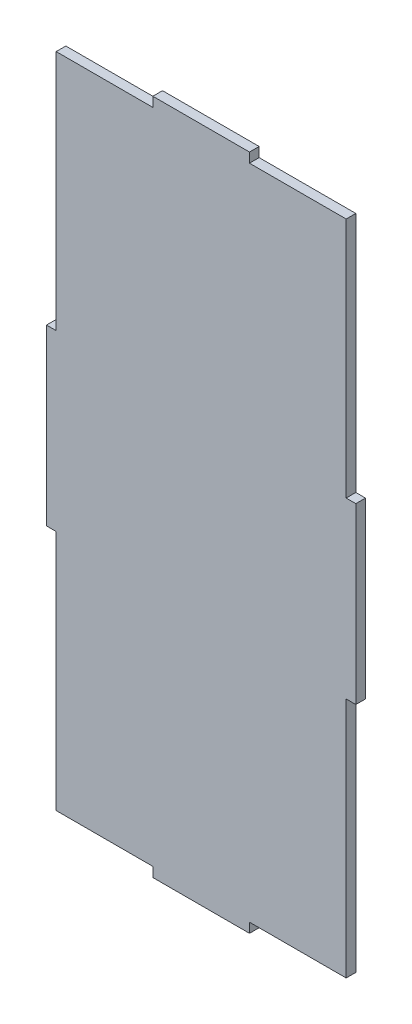
ISO-10303-21;
HEADER;
FILE_DESCRIPTION(('STEP AP214'),'2;1');
FILE_NAME('part.step','',(''),(''),'','','');
FILE_SCHEMA(('AUTOMOTIVE_DESIGN { 1 0 10303 214 1 1 1 1 }'));
ENDSEC;
DATA;
#1=APPLICATION_CONTEXT('core data for automotive mechanical design processes');
#2=APPLICATION_PROTOCOL_DEFINITION('international standard','automotive_design',2000,#1);
#3=PRODUCT_CONTEXT('',#1,'mechanical');
#4=PRODUCT('Part','Part','',(#3));
#5=PRODUCT_RELATED_PRODUCT_CATEGORY('part','',(#4));
#6=PRODUCT_DEFINITION_FORMATION('','',#4);
#7=PRODUCT_DEFINITION_CONTEXT('part definition',#1,'design');
#8=PRODUCT_DEFINITION('design','',#6,#7);
#9=PRODUCT_DEFINITION_SHAPE('','',#8);
#10=(LENGTH_UNIT() NAMED_UNIT(*) SI_UNIT(.MILLI.,.METRE.));
#11=(NAMED_UNIT(*) PLANE_ANGLE_UNIT() SI_UNIT($,.RADIAN.));
#12=(NAMED_UNIT(*) SI_UNIT($,.STERADIAN.) SOLID_ANGLE_UNIT());
#13=UNCERTAINTY_MEASURE_WITH_UNIT(LENGTH_MEASURE(1.E-05),#10,'distance_accuracy_value','');
#14=(GEOMETRIC_REPRESENTATION_CONTEXT(3) GLOBAL_UNCERTAINTY_ASSIGNED_CONTEXT((#13)) GLOBAL_UNIT_ASSIGNED_CONTEXT((#10,
#11,#12)) REPRESENTATION_CONTEXT('',''));
#15=CARTESIAN_POINT('',(0.,0.,0.));
#16=DIRECTION('',(0.,0.,1.));
#17=DIRECTION('',(1.,0.,0.));
#18=AXIS2_PLACEMENT_3D('',#15,#16,#17);
#19=CARTESIAN_POINT('',(0.,0.,6.35));
#20=DIRECTION('',(0.,0.,1.));
#21=DIRECTION('',(1.,0.,0.));
#22=AXIS2_PLACEMENT_3D('',#19,#20,#21);
#23=PLANE('',#22);
#24=DIRECTION('',(0.,1.,0.));
#25=VECTOR('',#24,1.);
#26=CARTESIAN_POINT('',(-437.71235835235,2.12580200527452E-13,6.35));
#27=LINE('',#26,#25);
#28=CARTESIAN_POINT('',(-437.71235835235,116.758620123206,6.34999999999997));
#29=VERTEX_POINT('',#28);
#30=CARTESIAN_POINT('',(-437.71235835235,231.058620123206,6.35));
#31=VERTEX_POINT('',#30);
#32=EDGE_CURVE('E48',#29,#31,#27,.T.);
#33=ORIENTED_EDGE('',*,*,#32,.F.);
#34=DIRECTION('',(-1.,0.,0.));
#35=VECTOR('',#34,1.);
#36=CARTESIAN_POINT('',(1.27586720850635E-13,116.758620123206,6.35));
#37=LINE('',#36,#35);
#38=CARTESIAN_POINT('',(-431.36235835235,116.758620123206,6.34999999999997));
#39=VERTEX_POINT('',#38);
#40=EDGE_CURVE('E179',#39,#29,#37,.T.);
#41=ORIENTED_EDGE('',*,*,#40,.F.);
#42=DIRECTION('',(0.,1.,0.));
#43=VECTOR('',#42,1.);
#44=CARTESIAN_POINT('',(-431.36235835235,0.,6.35));
#45=LINE('',#44,#43);
#46=CARTESIAN_POINT('',(-431.36235835235,-41.9913798767936,6.34999999999997));
#47=VERTEX_POINT('',#46);
#48=EDGE_CURVE('E192',#47,#39,#45,.T.);
#49=ORIENTED_EDGE('',*,*,#48,.F.);
#50=DIRECTION('',(-1.,0.,0.));
#51=VECTOR('',#50,1.);
#52=CARTESIAN_POINT('',(0.,-41.9913798767937,6.35));
#53=LINE('',#52,#51);
#54=CARTESIAN_POINT('',(-367.86235835235,-41.9913798767936,6.34999999999997));
#55=VERTEX_POINT('',#54);
#56=EDGE_CURVE('E280',#55,#47,#53,.T.);
#57=ORIENTED_EDGE('',*,*,#56,.F.);
#58=DIRECTION('',(0.,1.,0.));
#59=VECTOR('',#58,1.);
#60=CARTESIAN_POINT('',(-367.86235835235,0.,6.35));
#61=LINE('',#60,#59);
#62=CARTESIAN_POINT('',(-367.86235835235,-48.3413798767936,6.35));
#63=VERTEX_POINT('',#62);
#64=EDGE_CURVE('E278',#63,#55,#61,.T.);
#65=ORIENTED_EDGE('',*,*,#64,.F.);
#66=DIRECTION('',(-1.,0.,0.));
#67=VECTOR('',#66,1.);
#68=CARTESIAN_POINT('',(0.,-48.3413798767935,6.35));
#69=LINE('',#68,#67);
#70=CARTESIAN_POINT('',(-304.36235835235,-48.3413798767936,6.34999999999997));
#71=VERTEX_POINT('',#70);
#72=EDGE_CURVE('E264',#71,#63,#69,.T.);
#73=ORIENTED_EDGE('',*,*,#72,.F.);
#74=DIRECTION('',(0.,1.,0.));
#75=VECTOR('',#74,1.);
#76=CARTESIAN_POINT('',(-304.36235835235,0.,6.35));
#77=LINE('',#76,#75);
#78=CARTESIAN_POINT('',(-304.36235835235,-41.9913798767936,6.35));
#79=VERTEX_POINT('',#78);
#80=EDGE_CURVE('E270',#71,#79,#77,.T.);
#81=ORIENTED_EDGE('',*,*,#80,.T.);
#82=DIRECTION('',(1.,0.,0.));
#83=VECTOR('',#82,1.);
#84=CARTESIAN_POINT('',(0.,-41.9913798767936,6.35));
#85=LINE('',#84,#83);
#86=CARTESIAN_POINT('',(-240.86235835235,-41.9913798767936,6.35));
#87=VERTEX_POINT('',#86);
#88=EDGE_CURVE('E272',#79,#87,#85,.T.);
#89=ORIENTED_EDGE('',*,*,#88,.T.);
#90=DIRECTION('',(0.,-1.,0.));
#91=VECTOR('',#90,1.);
#92=CARTESIAN_POINT('',(-240.86235835235,0.,6.35));
#93=LINE('',#92,#91);
#94=CARTESIAN_POINT('',(-240.86235835235,116.758620123206,6.35));
#95=VERTEX_POINT('',#94);
#96=EDGE_CURVE('E220',#95,#87,#93,.T.);
#97=ORIENTED_EDGE('',*,*,#96,.F.);
#98=DIRECTION('',(-1.,0.,0.));
#99=VECTOR('',#98,1.);
#100=CARTESIAN_POINT('',(0.,116.758620123206,6.35));
#101=LINE('',#100,#99);
#102=CARTESIAN_POINT('',(-234.51235835235,116.758620123206,6.35));
#103=VERTEX_POINT('',#102);
#104=EDGE_CURVE('E225',#103,#95,#101,.T.);
#105=ORIENTED_EDGE('',*,*,#104,.F.);
#106=DIRECTION('',(0.,-1.,0.));
#107=VECTOR('',#106,1.);
#108=CARTESIAN_POINT('',(-234.51235835235,231.058620123206,6.35));
#109=LINE('',#108,#107);
#110=CARTESIAN_POINT('',(-234.51235835235,231.058620123206,6.35));
#111=VERTEX_POINT('',#110);
#112=EDGE_CURVE('E190',#111,#103,#109,.T.);
#113=ORIENTED_EDGE('',*,*,#112,.F.);
#114=DIRECTION('',(-1.,0.,0.));
#115=VECTOR('',#114,1.);
#116=CARTESIAN_POINT('',(0.,231.058620123206,6.35));
#117=LINE('',#116,#115);
#118=CARTESIAN_POINT('',(-240.86235835235,231.058620123206,6.35));
#119=VERTEX_POINT('',#118);
#120=EDGE_CURVE('E212',#111,#119,#117,.T.);
#121=ORIENTED_EDGE('',*,*,#120,.T.);
#122=DIRECTION('',(0.,1.,0.));
#123=VECTOR('',#122,1.);
#124=CARTESIAN_POINT('',(-240.86235835235,0.,6.35));
#125=LINE('',#124,#123);
#126=CARTESIAN_POINT('',(-240.86235835235,389.808620123206,6.34999999999997));
#127=VERTEX_POINT('',#126);
#128=EDGE_CURVE('E207',#119,#127,#125,.T.);
#129=ORIENTED_EDGE('',*,*,#128,.T.);
#130=DIRECTION('',(1.,0.,0.));
#131=VECTOR('',#130,1.);
#132=CARTESIAN_POINT('',(0.,389.808620123206,6.35));
#133=LINE('',#132,#131);
#134=CARTESIAN_POINT('',(-304.36235835235,389.808620123206,6.34999999999997));
#135=VERTEX_POINT('',#134);
#136=EDGE_CURVE('E241',#135,#127,#133,.T.);
#137=ORIENTED_EDGE('',*,*,#136,.F.);
#138=DIRECTION('',(0.,-1.,0.));
#139=VECTOR('',#138,1.);
#140=CARTESIAN_POINT('',(-304.36235835235,0.,6.35));
#141=LINE('',#140,#139);
#142=CARTESIAN_POINT('',(-304.36235835235,396.158620123206,6.35));
#143=VERTEX_POINT('',#142);
#144=EDGE_CURVE('E245',#143,#135,#141,.T.);
#145=ORIENTED_EDGE('',*,*,#144,.F.);
#146=DIRECTION('',(1.,0.,0.));
#147=VECTOR('',#146,1.);
#148=CARTESIAN_POINT('',(0.,396.158620123206,6.35));
#149=LINE('',#148,#147);
#150=CARTESIAN_POINT('',(-367.86235835235,396.158620123206,6.34999999999997));
#151=VERTEX_POINT('',#150);
#152=EDGE_CURVE('E233',#151,#143,#149,.T.);
#153=ORIENTED_EDGE('',*,*,#152,.F.);
#154=DIRECTION('',(0.,-1.,0.));
#155=VECTOR('',#154,1.);
#156=CARTESIAN_POINT('',(-367.86235835235,0.,6.35));
#157=LINE('',#156,#155);
#158=CARTESIAN_POINT('',(-367.86235835235,389.808620123206,6.35));
#159=VERTEX_POINT('',#158);
#160=EDGE_CURVE('E257',#151,#159,#157,.T.);
#161=ORIENTED_EDGE('',*,*,#160,.T.);
#162=DIRECTION('',(-1.,0.,0.));
#163=VECTOR('',#162,1.);
#164=CARTESIAN_POINT('',(0.,389.808620123206,6.35));
#165=LINE('',#164,#163);
#166=CARTESIAN_POINT('',(-431.36235835235,389.808620123206,6.35));
#167=VERTEX_POINT('',#166);
#168=EDGE_CURVE('E252',#159,#167,#165,.T.);
#169=ORIENTED_EDGE('',*,*,#168,.T.);
#170=DIRECTION('',(0.,1.,0.));
#171=VECTOR('',#170,1.);
#172=CARTESIAN_POINT('',(-431.36235835235,0.,6.35));
#173=LINE('',#172,#171);
#174=CARTESIAN_POINT('',(-431.36235835235,231.058620123206,6.35));
#175=VERTEX_POINT('',#174);
#176=EDGE_CURVE('E314',#175,#167,#173,.T.);
#177=ORIENTED_EDGE('',*,*,#176,.F.);
#178=DIRECTION('',(1.,0.,0.));
#179=VECTOR('',#178,1.);
#180=CARTESIAN_POINT('',(0.,231.058620123206,6.35));
#181=LINE('',#180,#179);
#182=EDGE_CURVE('E54',#31,#175,#181,.T.);
#183=ORIENTED_EDGE('',*,*,#182,.F.);
#184=EDGE_LOOP('',(#33,#41,#49,#57,#65,#73,#81,#89,#97,#105,#113,#121,#129,#137,#145,#153,#161,
#169,#177,#183));
#185=FACE_BOUND('',#184,.T.);
#186=ADVANCED_FACE('F33',(#185),#23,.T.);
#187=CARTESIAN_POINT('',(0.,0.,0.));
#188=DIRECTION('',(0.,0.,1.));
#189=DIRECTION('',(1.,0.,0.));
#190=AXIS2_PLACEMENT_3D('',#187,#188,#189);
#191=PLANE('',#190);
#192=DIRECTION('',(-1.,0.,0.));
#193=VECTOR('',#192,1.);
#194=CARTESIAN_POINT('',(1.27586720850635E-13,116.758620123206,0.));
#195=LINE('',#194,#193);
#196=CARTESIAN_POINT('',(-431.36235835235,116.758620123206,0.));
#197=VERTEX_POINT('',#196);
#198=CARTESIAN_POINT('',(-437.71235835235,116.758620123206,0.));
#199=VERTEX_POINT('',#198);
#200=EDGE_CURVE('E187',#197,#199,#195,.T.);
#201=ORIENTED_EDGE('',*,*,#200,.T.);
#202=DIRECTION('',(0.,1.,0.));
#203=VECTOR('',#202,1.);
#204=CARTESIAN_POINT('',(-437.71235835235,2.12580200527452E-13,0.));
#205=LINE('',#204,#203);
#206=CARTESIAN_POINT('',(-437.71235835235,231.058620123206,0.));
#207=VERTEX_POINT('',#206);
#208=EDGE_CURVE('E171',#199,#207,#205,.T.);
#209=ORIENTED_EDGE('',*,*,#208,.T.);
#210=DIRECTION('',(1.,0.,0.));
#211=VECTOR('',#210,1.);
#212=CARTESIAN_POINT('',(0.,231.058620123206,0.));
#213=LINE('',#212,#211);
#214=CARTESIAN_POINT('',(-431.36235835235,231.058620123206,0.));
#215=VERTEX_POINT('',#214);
#216=EDGE_CURVE('E328',#207,#215,#213,.T.);
#217=ORIENTED_EDGE('',*,*,#216,.T.);
#218=DIRECTION('',(0.,1.,0.));
#219=VECTOR('',#218,1.);
#220=CARTESIAN_POINT('',(-431.36235835235,0.,0.));
#221=LINE('',#220,#219);
#222=CARTESIAN_POINT('',(-431.36235835235,389.808620123206,0.));
#223=VERTEX_POINT('',#222);
#224=EDGE_CURVE('E313',#215,#223,#221,.T.);
#225=ORIENTED_EDGE('',*,*,#224,.T.);
#226=DIRECTION('',(-1.,0.,0.));
#227=VECTOR('',#226,1.);
#228=CARTESIAN_POINT('',(0.,389.808620123206,0.));
#229=LINE('',#228,#227);
#230=CARTESIAN_POINT('',(-367.86235835235,389.808620123206,0.));
#231=VERTEX_POINT('',#230);
#232=EDGE_CURVE('E250',#231,#223,#229,.T.);
#233=ORIENTED_EDGE('',*,*,#232,.F.);
#234=DIRECTION('',(0.,-1.,0.));
#235=VECTOR('',#234,1.);
#236=CARTESIAN_POINT('',(-367.86235835235,0.,0.));
#237=LINE('',#236,#235);
#238=CARTESIAN_POINT('',(-367.86235835235,396.158620123206,0.));
#239=VERTEX_POINT('',#238);
#240=EDGE_CURVE('E255',#239,#231,#237,.T.);
#241=ORIENTED_EDGE('',*,*,#240,.F.);
#242=DIRECTION('',(1.,0.,0.));
#243=VECTOR('',#242,1.);
#244=CARTESIAN_POINT('',(0.,396.158620123206,0.));
#245=LINE('',#244,#243);
#246=CARTESIAN_POINT('',(-304.36235835235,396.158620123206,0.));
#247=VERTEX_POINT('',#246);
#248=EDGE_CURVE('E230',#239,#247,#245,.T.);
#249=ORIENTED_EDGE('',*,*,#248,.T.);
#250=DIRECTION('',(0.,-1.,0.));
#251=VECTOR('',#250,1.);
#252=CARTESIAN_POINT('',(-304.36235835235,0.,0.));
#253=LINE('',#252,#251);
#254=CARTESIAN_POINT('',(-304.36235835235,389.808620123206,0.));
#255=VERTEX_POINT('',#254);
#256=EDGE_CURVE('E243',#247,#255,#253,.T.);
#257=ORIENTED_EDGE('',*,*,#256,.T.);
#258=DIRECTION('',(1.,0.,0.));
#259=VECTOR('',#258,1.);
#260=CARTESIAN_POINT('',(0.,389.808620123206,0.));
#261=LINE('',#260,#259);
#262=CARTESIAN_POINT('',(-240.86235835235,389.808620123206,0.));
#263=VERTEX_POINT('',#262);
#264=EDGE_CURVE('E238',#255,#263,#261,.T.);
#265=ORIENTED_EDGE('',*,*,#264,.T.);
#266=DIRECTION('',(0.,1.,0.));
#267=VECTOR('',#266,1.);
#268=CARTESIAN_POINT('',(-240.86235835235,0.,0.));
#269=LINE('',#268,#267);
#270=CARTESIAN_POINT('',(-240.86235835235,231.058620123206,0.));
#271=VERTEX_POINT('',#270);
#272=EDGE_CURVE('E204',#271,#263,#269,.T.);
#273=ORIENTED_EDGE('',*,*,#272,.F.);
#274=DIRECTION('',(-1.,0.,0.));
#275=VECTOR('',#274,1.);
#276=CARTESIAN_POINT('',(0.,231.058620123206,0.));
#277=LINE('',#276,#275);
#278=CARTESIAN_POINT('',(-234.51235835235,231.058620123206,0.));
#279=VERTEX_POINT('',#278);
#280=EDGE_CURVE('E210',#279,#271,#277,.T.);
#281=ORIENTED_EDGE('',*,*,#280,.F.);
#282=DIRECTION('',(0.,1.,0.));
#283=VECTOR('',#282,1.);
#284=CARTESIAN_POINT('',(-234.51235835235,0.,0.));
#285=LINE('',#284,#283);
#286=CARTESIAN_POINT('',(-234.51235835235,116.758620123206,0.));
#287=VERTEX_POINT('',#286);
#288=EDGE_CURVE('E198',#287,#279,#285,.T.);
#289=ORIENTED_EDGE('',*,*,#288,.F.);
#290=DIRECTION('',(-1.,0.,0.));
#291=VECTOR('',#290,1.);
#292=CARTESIAN_POINT('',(0.,116.758620123206,0.));
#293=LINE('',#292,#291);
#294=CARTESIAN_POINT('',(-240.86235835235,116.758620123206,0.));
#295=VERTEX_POINT('',#294);
#296=EDGE_CURVE('E223',#287,#295,#293,.T.);
#297=ORIENTED_EDGE('',*,*,#296,.T.);
#298=DIRECTION('',(0.,-1.,0.));
#299=VECTOR('',#298,1.);
#300=CARTESIAN_POINT('',(-240.86235835235,0.,0.));
#301=LINE('',#300,#299);
#302=CARTESIAN_POINT('',(-240.86235835235,-41.9913798767936,0.));
#303=VERTEX_POINT('',#302);
#304=EDGE_CURVE('E217',#295,#303,#301,.T.);
#305=ORIENTED_EDGE('',*,*,#304,.T.);
#306=DIRECTION('',(1.,0.,0.));
#307=VECTOR('',#306,1.);
#308=CARTESIAN_POINT('',(0.,-41.9913798767936,0.));
#309=LINE('',#308,#307);
#310=CARTESIAN_POINT('',(-304.36235835235,-41.9913798767936,0.));
#311=VERTEX_POINT('',#310);
#312=EDGE_CURVE('E290',#311,#303,#309,.T.);
#313=ORIENTED_EDGE('',*,*,#312,.F.);
#314=DIRECTION('',(0.,1.,0.));
#315=VECTOR('',#314,1.);
#316=CARTESIAN_POINT('',(-304.36235835235,0.,0.));
#317=LINE('',#316,#315);
#318=CARTESIAN_POINT('',(-304.36235835235,-48.3413798767936,0.));
#319=VERTEX_POINT('',#318);
#320=EDGE_CURVE('E288',#319,#311,#317,.T.);
#321=ORIENTED_EDGE('',*,*,#320,.F.);
#322=DIRECTION('',(-1.,0.,0.));
#323=VECTOR('',#322,1.);
#324=CARTESIAN_POINT('',(0.,-48.3413798767935,0.));
#325=LINE('',#324,#323);
#326=CARTESIAN_POINT('',(-367.86235835235,-48.3413798767936,0.));
#327=VERTEX_POINT('',#326);
#328=EDGE_CURVE('E262',#319,#327,#325,.T.);
#329=ORIENTED_EDGE('',*,*,#328,.T.);
#330=DIRECTION('',(0.,1.,0.));
#331=VECTOR('',#330,1.);
#332=CARTESIAN_POINT('',(-367.86235835235,0.,0.));
#333=LINE('',#332,#331);
#334=CARTESIAN_POINT('',(-367.86235835235,-41.9913798767936,0.));
#335=VERTEX_POINT('',#334);
#336=EDGE_CURVE('E283',#327,#335,#333,.T.);
#337=ORIENTED_EDGE('',*,*,#336,.T.);
#338=DIRECTION('',(-1.,0.,0.));
#339=VECTOR('',#338,1.);
#340=CARTESIAN_POINT('',(0.,-41.9913798767937,0.));
#341=LINE('',#340,#339);
#342=CARTESIAN_POINT('',(-431.36235835235,-41.9913798767936,0.));
#343=VERTEX_POINT('',#342);
#344=EDGE_CURVE('E285',#335,#343,#341,.T.);
#345=ORIENTED_EDGE('',*,*,#344,.T.);
#346=DIRECTION('',(0.,1.,0.));
#347=VECTOR('',#346,1.);
#348=CARTESIAN_POINT('',(-431.36235835235,0.,0.));
#349=LINE('',#348,#347);
#350=EDGE_CURVE('E336',#343,#197,#349,.T.);
#351=ORIENTED_EDGE('',*,*,#350,.T.);
#352=EDGE_LOOP('',(#201,#209,#217,#225,#233,#241,#249,#257,#265,#273,#281,#289,#297,#305,#313,
#321,#329,#337,#345,#351));
#353=FACE_BOUND('',#352,.T.);
#354=ADVANCED_FACE('F35',(#353),#191,.F.);
#355=CARTESIAN_POINT('',(-240.86235835235,116.758620123206,624.099674347344));
#356=DIRECTION('',(0.,1.,0.));
#357=DIRECTION('',(0.,0.,1.));
#358=AXIS2_PLACEMENT_3D('',#355,#356,#357);
#359=PLANE('',#358);
#360=DIRECTION('',(0.,0.,-1.));
#361=VECTOR('',#360,1.);
#362=CARTESIAN_POINT('',(-234.51235835235,116.758620123206,6.35));
#363=LINE('',#362,#361);
#364=EDGE_CURVE('E197',#103,#287,#363,.T.);
#365=ORIENTED_EDGE('',*,*,#364,.F.);
#366=ORIENTED_EDGE('',*,*,#104,.T.);
#367=DIRECTION('',(0.,0.,-1.));
#368=VECTOR('',#367,1.);
#369=CARTESIAN_POINT('',(-240.86235835235,116.758620123206,624.099674347344));
#370=LINE('',#369,#368);
#371=EDGE_CURVE('E214',#95,#295,#370,.T.);
#372=ORIENTED_EDGE('',*,*,#371,.T.);
#373=ORIENTED_EDGE('',*,*,#296,.F.);
#374=EDGE_LOOP('',(#365,#366,#372,#373));
#375=FACE_BOUND('',#374,.T.);
#376=ADVANCED_FACE('F370',(#375),#359,.F.);
#377=CARTESIAN_POINT('',(-240.86235835235,231.058620123206,624.099674347344));
#378=DIRECTION('',(0.,1.,0.));
#379=DIRECTION('',(0.,0.,1.));
#380=AXIS2_PLACEMENT_3D('',#377,#378,#379);
#381=PLANE('',#380);
#382=ORIENTED_EDGE('',*,*,#120,.F.);
#383=DIRECTION('',(0.,0.,-1.));
#384=VECTOR('',#383,1.);
#385=CARTESIAN_POINT('',(-234.51235835235,231.058620123206,6.35));
#386=LINE('',#385,#384);
#387=EDGE_CURVE('E186',#111,#279,#386,.T.);
#388=ORIENTED_EDGE('',*,*,#387,.T.);
#389=ORIENTED_EDGE('',*,*,#280,.T.);
#390=DIRECTION('',(0.,0.,-1.));
#391=VECTOR('',#390,1.);
#392=CARTESIAN_POINT('',(-240.86235835235,231.058620123206,624.099674347344));
#393=LINE('',#392,#391);
#394=EDGE_CURVE('E201',#119,#271,#393,.T.);
#395=ORIENTED_EDGE('',*,*,#394,.F.);
#396=EDGE_LOOP('',(#382,#388,#389,#395));
#397=FACE_BOUND('',#396,.T.);
#398=ADVANCED_FACE('F377',(#397),#381,.T.);
#399=CARTESIAN_POINT('',(-228.16235835235,389.808620123206,631.248560518025));
#400=DIRECTION('',(0.,-1.,0.));
#401=DIRECTION('',(0.,0.,-1.));
#402=AXIS2_PLACEMENT_3D('',#399,#400,#401);
#403=PLANE('',#402);
#404=DIRECTION('',(0.,0.,1.));
#405=VECTOR('',#404,1.);
#406=CARTESIAN_POINT('',(-240.86235835235,389.808620123206,631.248560518025));
#407=LINE('',#406,#405);
#408=EDGE_CURVE('E301',#263,#127,#407,.T.);
#409=ORIENTED_EDGE('',*,*,#408,.F.);
#410=ORIENTED_EDGE('',*,*,#264,.F.);
#411=DIRECTION('',(0.,0.,-1.));
#412=VECTOR('',#411,1.);
#413=CARTESIAN_POINT('',(-304.36235835235,389.808620123206,631.248560518025));
#414=LINE('',#413,#412);
#415=EDGE_CURVE('E235',#135,#255,#414,.T.);
#416=ORIENTED_EDGE('',*,*,#415,.F.);
#417=ORIENTED_EDGE('',*,*,#136,.T.);
#418=EDGE_LOOP('',(#409,#410,#416,#417));
#419=FACE_BOUND('',#418,.T.);
#420=ADVANCED_FACE('F385',(#419),#403,.F.);
#421=CARTESIAN_POINT('',(-444.06235835235,-41.9913798767936,646.353769888886));
#422=DIRECTION('',(0.,1.,0.));
#423=DIRECTION('',(-1.,0.,0.));
#424=AXIS2_PLACEMENT_3D('',#421,#422,#423);
#425=PLANE('',#424);
#426=ORIENTED_EDGE('',*,*,#56,.T.);
#427=DIRECTION('',(0.,0.,-1.));
#428=VECTOR('',#427,1.);
#429=CARTESIAN_POINT('',(-431.36235835235,-41.9913798767936,646.353769888886));
#430=LINE('',#429,#428);
#431=EDGE_CURVE('E304',#47,#343,#430,.T.);
#432=ORIENTED_EDGE('',*,*,#431,.T.);
#433=ORIENTED_EDGE('',*,*,#344,.F.);
#434=DIRECTION('',(0.,0.,-1.));
#435=VECTOR('',#434,1.);
#436=CARTESIAN_POINT('',(-367.86235835235,-41.9913798767936,646.353769888886));
#437=LINE('',#436,#435);
#438=EDGE_CURVE('E275',#55,#335,#437,.T.);
#439=ORIENTED_EDGE('',*,*,#438,.F.);
#440=EDGE_LOOP('',(#426,#432,#433,#439));
#441=FACE_BOUND('',#440,.T.);
#442=ADVANCED_FACE('F344',(#441),#425,.F.);
#443=CARTESIAN_POINT('',(-367.86235835235,-41.9913798767936,646.353769888886));
#444=DIRECTION('',(1.,0.,0.));
#445=DIRECTION('',(0.,0.,-1.));
#446=AXIS2_PLACEMENT_3D('',#443,#444,#445);
#447=PLANE('',#446);
#448=ORIENTED_EDGE('',*,*,#336,.F.);
#449=DIRECTION('',(0.,0.,-1.));
#450=VECTOR('',#449,1.);
#451=CARTESIAN_POINT('',(-367.86235835235,-48.3413798767936,646.353769888886));
#452=LINE('',#451,#450);
#453=EDGE_CURVE('E259',#63,#327,#452,.T.);
#454=ORIENTED_EDGE('',*,*,#453,.F.);
#455=ORIENTED_EDGE('',*,*,#64,.T.);
#456=ORIENTED_EDGE('',*,*,#438,.T.);
#457=EDGE_LOOP('',(#448,#454,#455,#456));
#458=FACE_BOUND('',#457,.T.);
#459=ADVANCED_FACE('F348',(#458),#447,.F.);
#460=CARTESIAN_POINT('',(-228.16235835235,-41.9913798767936,646.353769888886));
#461=DIRECTION('',(0.,-1.,0.));
#462=DIRECTION('',(1.,0.,0.));
#463=AXIS2_PLACEMENT_3D('',#460,#461,#462);
#464=PLANE('',#463);
#465=DIRECTION('',(0.,0.,-1.));
#466=VECTOR('',#465,1.);
#467=CARTESIAN_POINT('',(-240.86235835235,-41.9913798767936,646.353769888886));
#468=LINE('',#467,#466);
#469=EDGE_CURVE('E298',#87,#303,#468,.T.);
#470=ORIENTED_EDGE('',*,*,#469,.F.);
#471=ORIENTED_EDGE('',*,*,#88,.F.);
#472=DIRECTION('',(0.,0.,-1.));
#473=VECTOR('',#472,1.);
#474=CARTESIAN_POINT('',(-304.36235835235,-41.9913798767936,646.353769888886));
#475=LINE('',#474,#473);
#476=EDGE_CURVE('E267',#79,#311,#475,.T.);
#477=ORIENTED_EDGE('',*,*,#476,.T.);
#478=ORIENTED_EDGE('',*,*,#312,.T.);
#479=EDGE_LOOP('',(#470,#471,#477,#478));
#480=FACE_BOUND('',#479,.T.);
#481=ADVANCED_FACE('F361',(#480),#464,.T.);
#482=CARTESIAN_POINT('',(-304.36235835235,-41.9913798767936,646.353769888886));
#483=DIRECTION('',(1.,0.,0.));
#484=DIRECTION('',(0.,0.,-1.));
#485=AXIS2_PLACEMENT_3D('',#482,#483,#484);
#486=PLANE('',#485);
#487=DIRECTION('',(0.,0.,1.));
#488=VECTOR('',#487,1.);
#489=CARTESIAN_POINT('',(-304.36235835235,-48.3413798767936,646.353769888886));
#490=LINE('',#489,#488);
#491=EDGE_CURVE('E292',#319,#71,#490,.T.);
#492=ORIENTED_EDGE('',*,*,#491,.F.);
#493=ORIENTED_EDGE('',*,*,#320,.T.);
#494=ORIENTED_EDGE('',*,*,#476,.F.);
#495=ORIENTED_EDGE('',*,*,#80,.F.);
#496=EDGE_LOOP('',(#492,#493,#494,#495));
#497=FACE_BOUND('',#496,.T.);
#498=ADVANCED_FACE('F355',(#497),#486,.T.);
#499=CARTESIAN_POINT('',(-367.86235835235,-48.3413798767936,646.353769888886));
#500=DIRECTION('',(0.,1.,0.));
#501=DIRECTION('',(-1.,0.,0.));
#502=AXIS2_PLACEMENT_3D('',#499,#500,#501);
#503=PLANE('',#502);
#504=ORIENTED_EDGE('',*,*,#491,.T.);
#505=ORIENTED_EDGE('',*,*,#72,.T.);
#506=ORIENTED_EDGE('',*,*,#453,.T.);
#507=ORIENTED_EDGE('',*,*,#328,.F.);
#508=EDGE_LOOP('',(#504,#505,#506,#507));
#509=FACE_BOUND('',#508,.T.);
#510=ADVANCED_FACE('F351',(#509),#503,.F.);
#511=CARTESIAN_POINT('',(-367.86235835235,389.808620123206,639.186060518025));
#512=DIRECTION('',(-1.,0.,0.));
#513=DIRECTION('',(0.,0.,1.));
#514=AXIS2_PLACEMENT_3D('',#511,#512,#513);
#515=PLANE('',#514);
#516=DIRECTION('',(0.,0.,-1.));
#517=VECTOR('',#516,1.);
#518=CARTESIAN_POINT('',(-367.86235835235,396.158620123206,631.248560518025));
#519=LINE('',#518,#517);
#520=EDGE_CURVE('E227',#151,#239,#519,.T.);
#521=ORIENTED_EDGE('',*,*,#520,.T.);
#522=ORIENTED_EDGE('',*,*,#240,.T.);
#523=DIRECTION('',(0.,0.,-1.));
#524=VECTOR('',#523,1.);
#525=CARTESIAN_POINT('',(-367.86235835235,389.808620123206,639.186060518025));
#526=LINE('',#525,#524);
#527=EDGE_CURVE('E247',#159,#231,#526,.T.);
#528=ORIENTED_EDGE('',*,*,#527,.F.);
#529=ORIENTED_EDGE('',*,*,#160,.F.);
#530=EDGE_LOOP('',(#521,#522,#528,#529));
#531=FACE_BOUND('',#530,.T.);
#532=ADVANCED_FACE('F324',(#531),#515,.T.);
#533=CARTESIAN_POINT('',(-444.06235835235,389.808620123206,639.186060518025));
#534=DIRECTION('',(0.,1.,0.));
#535=DIRECTION('',(0.,0.,1.));
#536=AXIS2_PLACEMENT_3D('',#533,#534,#535);
#537=PLANE('',#536);
#538=DIRECTION('',(0.,0.,-1.));
#539=VECTOR('',#538,1.);
#540=CARTESIAN_POINT('',(-431.36235835235,389.808620123206,639.186060518025));
#541=LINE('',#540,#539);
#542=EDGE_CURVE('E41',#167,#223,#541,.T.);
#543=ORIENTED_EDGE('',*,*,#542,.F.);
#544=ORIENTED_EDGE('',*,*,#168,.F.);
#545=ORIENTED_EDGE('',*,*,#527,.T.);
#546=ORIENTED_EDGE('',*,*,#232,.T.);
#547=EDGE_LOOP('',(#543,#544,#545,#546));
#548=FACE_BOUND('',#547,.T.);
#549=ADVANCED_FACE('F317',(#548),#537,.T.);
#550=CARTESIAN_POINT('',(-304.36235835235,389.808620123206,631.248560518025));
#551=DIRECTION('',(-1.,0.,0.));
#552=DIRECTION('',(0.,0.,1.));
#553=AXIS2_PLACEMENT_3D('',#550,#551,#552);
#554=PLANE('',#553);
#555=ORIENTED_EDGE('',*,*,#256,.F.);
#556=DIRECTION('',(0.,0.,1.));
#557=VECTOR('',#556,1.);
#558=CARTESIAN_POINT('',(-304.36235835235,396.158620123206,631.248560518025));
#559=LINE('',#558,#557);
#560=EDGE_CURVE('E295',#247,#143,#559,.T.);
#561=ORIENTED_EDGE('',*,*,#560,.T.);
#562=ORIENTED_EDGE('',*,*,#144,.T.);
#563=ORIENTED_EDGE('',*,*,#415,.T.);
#564=EDGE_LOOP('',(#555,#561,#562,#563));
#565=FACE_BOUND('',#564,.T.);
#566=ADVANCED_FACE('F389',(#565),#554,.F.);
#567=CARTESIAN_POINT('',(-304.36235835235,396.158620123206,631.248560518025));
#568=DIRECTION('',(0.,-1.,0.));
#569=DIRECTION('',(0.,0.,-1.));
#570=AXIS2_PLACEMENT_3D('',#567,#568,#569);
#571=PLANE('',#570);
#572=ORIENTED_EDGE('',*,*,#520,.F.);
#573=ORIENTED_EDGE('',*,*,#152,.T.);
#574=ORIENTED_EDGE('',*,*,#560,.F.);
#575=ORIENTED_EDGE('',*,*,#248,.F.);
#576=EDGE_LOOP('',(#572,#573,#574,#575));
#577=FACE_BOUND('',#576,.T.);
#578=ADVANCED_FACE('F391',(#577),#571,.F.);
#579=CARTESIAN_POINT('',(-240.86235835235,-41.9913798767936,624.099674347344));
#580=DIRECTION('',(-1.,0.,0.));
#581=DIRECTION('',(0.,0.,1.));
#582=AXIS2_PLACEMENT_3D('',#579,#580,#581);
#583=PLANE('',#582);
#584=ORIENTED_EDGE('',*,*,#371,.F.);
#585=ORIENTED_EDGE('',*,*,#96,.T.);
#586=ORIENTED_EDGE('',*,*,#469,.T.);
#587=ORIENTED_EDGE('',*,*,#304,.F.);
#588=EDGE_LOOP('',(#584,#585,#586,#587));
#589=FACE_BOUND('',#588,.T.);
#590=ADVANCED_FACE('F366',(#589),#583,.F.);
#591=CARTESIAN_POINT('',(-240.86235835235,389.808620123206,624.099674347344));
#592=DIRECTION('',(1.,0.,0.));
#593=DIRECTION('',(0.,1.,0.));
#594=AXIS2_PLACEMENT_3D('',#591,#592,#593);
#595=PLANE('',#594);
#596=ORIENTED_EDGE('',*,*,#128,.F.);
#597=ORIENTED_EDGE('',*,*,#394,.T.);
#598=ORIENTED_EDGE('',*,*,#272,.T.);
#599=ORIENTED_EDGE('',*,*,#408,.T.);
#600=EDGE_LOOP('',(#596,#597,#598,#599));
#601=FACE_BOUND('',#600,.T.);
#602=ADVANCED_FACE('F381',(#601),#595,.T.);
#603=CARTESIAN_POINT('',(-234.51235835235,231.058620123206,6.35));
#604=DIRECTION('',(1.,0.,0.));
#605=DIRECTION('',(0.,0.,-1.));
#606=AXIS2_PLACEMENT_3D('',#603,#604,#605);
#607=PLANE('',#606);
#608=ORIENTED_EDGE('',*,*,#364,.T.);
#609=ORIENTED_EDGE('',*,*,#288,.T.);
#610=ORIENTED_EDGE('',*,*,#387,.F.);
#611=ORIENTED_EDGE('',*,*,#112,.T.);
#612=EDGE_LOOP('',(#608,#609,#610,#611));
#613=FACE_BOUND('',#612,.T.);
#614=ADVANCED_FACE('F393',(#613),#607,.T.);
#615=CARTESIAN_POINT('',(-444.06235835235,116.758620123206,620.673529125737));
#616=DIRECTION('',(0.,1.,0.));
#617=DIRECTION('',(-1.,0.,0.));
#618=AXIS2_PLACEMENT_3D('',#615,#616,#617);
#619=PLANE('',#618);
#620=ORIENTED_EDGE('',*,*,#40,.T.);
#621=DIRECTION('',(0.,0.,-1.));
#622=VECTOR('',#621,1.);
#623=CARTESIAN_POINT('',(-437.71235835235,116.758620123206,620.673529125737));
#624=LINE('',#623,#622);
#625=EDGE_CURVE('E168',#29,#199,#624,.T.);
#626=ORIENTED_EDGE('',*,*,#625,.T.);
#627=ORIENTED_EDGE('',*,*,#200,.F.);
#628=DIRECTION('',(0.,0.,-1.));
#629=VECTOR('',#628,1.);
#630=CARTESIAN_POINT('',(-431.36235835235,116.758620123206,620.673529125737));
#631=LINE('',#630,#629);
#632=EDGE_CURVE('E185',#39,#197,#631,.T.);
#633=ORIENTED_EDGE('',*,*,#632,.F.);
#634=EDGE_LOOP('',(#620,#626,#627,#633));
#635=FACE_BOUND('',#634,.T.);
#636=ADVANCED_FACE('F183',(#635),#619,.F.);
#637=CARTESIAN_POINT('',(-431.36235835235,-41.9913798767936,620.673529125737));
#638=DIRECTION('',(1.,0.,0.));
#639=DIRECTION('',(0.,0.,-1.));
#640=AXIS2_PLACEMENT_3D('',#637,#638,#639);
#641=PLANE('',#640);
#642=ORIENTED_EDGE('',*,*,#431,.F.);
#643=ORIENTED_EDGE('',*,*,#48,.T.);
#644=ORIENTED_EDGE('',*,*,#632,.T.);
#645=ORIENTED_EDGE('',*,*,#350,.F.);
#646=EDGE_LOOP('',(#642,#643,#644,#645));
#647=FACE_BOUND('',#646,.T.);
#648=ADVANCED_FACE('F339',(#647),#641,.F.);
#649=CARTESIAN_POINT('',(-431.36235835235,231.058620123206,620.673529125737));
#650=DIRECTION('',(0.,-1.,0.));
#651=DIRECTION('',(0.,0.,-1.));
#652=AXIS2_PLACEMENT_3D('',#649,#650,#651);
#653=PLANE('',#652);
#654=ORIENTED_EDGE('',*,*,#216,.F.);
#655=DIRECTION('',(0.,0.,1.));
#656=VECTOR('',#655,1.);
#657=CARTESIAN_POINT('',(-437.71235835235,231.058620123206,620.673529125737));
#658=LINE('',#657,#656);
#659=EDGE_CURVE('E11',#207,#31,#658,.T.);
#660=ORIENTED_EDGE('',*,*,#659,.T.);
#661=ORIENTED_EDGE('',*,*,#182,.T.);
#662=DIRECTION('',(0.,0.,-1.));
#663=VECTOR('',#662,1.);
#664=CARTESIAN_POINT('',(-431.36235835235,231.058620123206,620.673529125737));
#665=LINE('',#664,#663);
#666=EDGE_CURVE('E180',#175,#215,#665,.T.);
#667=ORIENTED_EDGE('',*,*,#666,.T.);
#668=EDGE_LOOP('',(#654,#660,#661,#667));
#669=FACE_BOUND('',#668,.T.);
#670=ADVANCED_FACE('F521',(#669),#653,.F.);
#671=CARTESIAN_POINT('',(-431.36235835235,389.808620123206,620.673529125737));
#672=DIRECTION('',(1.,0.,0.));
#673=DIRECTION('',(0.,0.,-1.));
#674=AXIS2_PLACEMENT_3D('',#671,#672,#673);
#675=PLANE('',#674);
#676=ORIENTED_EDGE('',*,*,#666,.F.);
#677=ORIENTED_EDGE('',*,*,#176,.T.);
#678=ORIENTED_EDGE('',*,*,#542,.T.);
#679=ORIENTED_EDGE('',*,*,#224,.F.);
#680=EDGE_LOOP('',(#676,#677,#678,#679));
#681=FACE_BOUND('',#680,.T.);
#682=ADVANCED_FACE('F311',(#681),#675,.F.);
#683=CARTESIAN_POINT('',(-437.71235835235,231.058620123206,620.673529125737));
#684=DIRECTION('',(1.,0.,0.));
#685=DIRECTION('',(0.,1.,0.));
#686=AXIS2_PLACEMENT_3D('',#683,#684,#685);
#687=PLANE('',#686);
#688=ORIENTED_EDGE('',*,*,#625,.F.);
#689=ORIENTED_EDGE('',*,*,#32,.T.);
#690=ORIENTED_EDGE('',*,*,#659,.F.);
#691=ORIENTED_EDGE('',*,*,#208,.F.);
#692=EDGE_LOOP('',(#688,#689,#690,#691));
#693=FACE_BOUND('',#692,.T.);
#694=ADVANCED_FACE('F169',(#693),#687,.F.);
#695=CLOSED_SHELL('',(#186,#354,#376,#398,#420,#442,#459,#481,#498,#510,#532,#549,#566,#578,
#590,#602,#614,#636,#648,#670,#682,#694));
#696=MANIFOLD_SOLID_BREP('B2',#695);
#697=ADVANCED_BREP_SHAPE_REPRESENTATION('',(#18,#696),#14);
#698=SHAPE_DEFINITION_REPRESENTATION(#9,#697);
ENDSEC;
END-ISO-10303-21;
